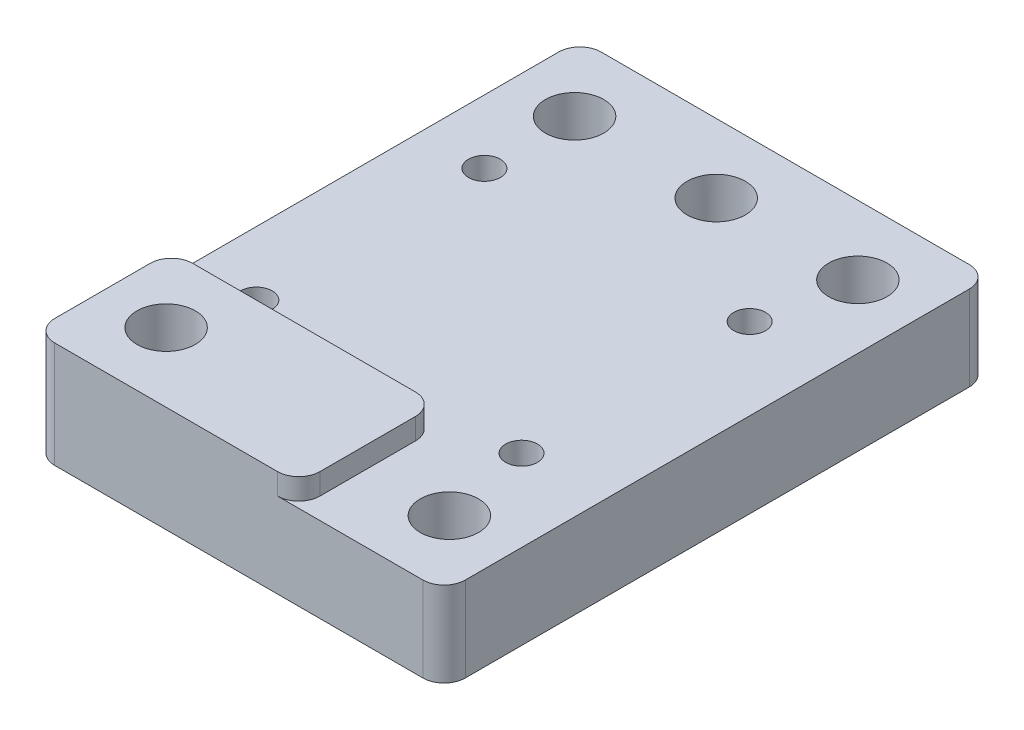
ISO-10303-21;
HEADER;
FILE_DESCRIPTION(('STEP AP214'),'2;1');
FILE_NAME('part.step','',(''),(''),'','','');
FILE_SCHEMA(('AUTOMOTIVE_DESIGN { 1 0 10303 214 1 1 1 1 }'));
ENDSEC;
DATA;
#1=APPLICATION_CONTEXT('core data for automotive mechanical design processes');
#2=APPLICATION_PROTOCOL_DEFINITION('international standard','automotive_design',2000,#1);
#3=PRODUCT_CONTEXT('',#1,'mechanical');
#4=PRODUCT('Part','Part','',(#3));
#5=PRODUCT_RELATED_PRODUCT_CATEGORY('part','',(#4));
#6=PRODUCT_DEFINITION_FORMATION('','',#4);
#7=PRODUCT_DEFINITION_CONTEXT('part definition',#1,'design');
#8=PRODUCT_DEFINITION('design','',#6,#7);
#9=PRODUCT_DEFINITION_SHAPE('','',#8);
#10=(LENGTH_UNIT() NAMED_UNIT(*) SI_UNIT(.MILLI.,.METRE.));
#11=(NAMED_UNIT(*) PLANE_ANGLE_UNIT() SI_UNIT($,.RADIAN.));
#12=(NAMED_UNIT(*) SI_UNIT($,.STERADIAN.) SOLID_ANGLE_UNIT());
#13=UNCERTAINTY_MEASURE_WITH_UNIT(LENGTH_MEASURE(1.E-05),#10,'distance_accuracy_value','');
#14=(GEOMETRIC_REPRESENTATION_CONTEXT(3) GLOBAL_UNCERTAINTY_ASSIGNED_CONTEXT((#13)) GLOBAL_UNIT_ASSIGNED_CONTEXT((#10,
#11,#12)) REPRESENTATION_CONTEXT('',''));
#15=CARTESIAN_POINT('',(0.,0.,0.));
#16=DIRECTION('',(0.,0.,1.));
#17=DIRECTION('',(1.,0.,0.));
#18=AXIS2_PLACEMENT_3D('',#15,#16,#17);
#19=CARTESIAN_POINT('',(0.,8.,0.));
#20=DIRECTION('',(0.,-1.,0.));
#21=DIRECTION('',(0.,0.,-1.));
#22=AXIS2_PLACEMENT_3D('',#19,#20,#21);
#23=PLANE('',#22);
#24=CARTESIAN_POINT('',(0.,8.,-19.25));
#25=DIRECTION('',(0.,-1.,0.));
#26=DIRECTION('',(0.,0.,-1.));
#27=AXIS2_PLACEMENT_3D('',#24,#25,#26);
#28=CIRCLE('',#27,2.75);
#29=CARTESIAN_POINT('',(0.,8.,-22.));
#30=VERTEX_POINT('',#29);
#31=EDGE_CURVE('E323',#30,#30,#28,.T.);
#32=ORIENTED_EDGE('',*,*,#31,.T.);
#33=EDGE_LOOP('',(#32));
#34=FACE_BOUND('',#33,.T.);
#35=CARTESIAN_POINT('',(13.35,8.,-19.25));
#36=DIRECTION('',(0.,-1.,0.));
#37=DIRECTION('',(0.,0.,-1.));
#38=AXIS2_PLACEMENT_3D('',#35,#36,#37);
#39=CIRCLE('',#38,2.75);
#40=CARTESIAN_POINT('',(13.35,8.,-22.));
#41=VERTEX_POINT('',#40);
#42=EDGE_CURVE('E317',#41,#41,#39,.F.);
#43=ORIENTED_EDGE('',*,*,#42,.F.);
#44=EDGE_LOOP('',(#43));
#45=FACE_BOUND('',#44,.T.);
#46=CARTESIAN_POINT('',(-13.35,8.,-19.25));
#47=DIRECTION('',(0.,-1.,0.));
#48=DIRECTION('',(0.,0.,-1.));
#49=AXIS2_PLACEMENT_3D('',#46,#47,#48);
#50=CIRCLE('',#49,2.75);
#51=CARTESIAN_POINT('',(-13.35,8.,-22.));
#52=VERTEX_POINT('',#51);
#53=EDGE_CURVE('E311',#52,#52,#50,.T.);
#54=ORIENTED_EDGE('',*,*,#53,.T.);
#55=EDGE_LOOP('',(#54));
#56=FACE_BOUND('',#55,.T.);
#57=CARTESIAN_POINT('',(13.35,8.,19.25));
#58=DIRECTION('',(0.,-1.,0.));
#59=DIRECTION('',(0.,0.,-1.));
#60=AXIS2_PLACEMENT_3D('',#57,#58,#59);
#61=CIRCLE('',#60,2.75);
#62=CARTESIAN_POINT('',(13.35,8.,16.5));
#63=VERTEX_POINT('',#62);
#64=EDGE_CURVE('E163',#63,#63,#61,.T.);
#65=ORIENTED_EDGE('',*,*,#64,.T.);
#66=EDGE_LOOP('',(#65));
#67=FACE_BOUND('',#66,.T.);
#68=CARTESIAN_POINT('',(-13.35,8.,-10.75));
#69=DIRECTION('',(0.,1.,0.));
#70=DIRECTION('',(0.,0.,1.));
#71=AXIS2_PLACEMENT_3D('',#68,#69,#70);
#72=CIRCLE('',#71,1.5);
#73=CARTESIAN_POINT('',(-13.35,8.,-9.25));
#74=VERTEX_POINT('',#73);
#75=EDGE_CURVE('E177',#74,#74,#72,.T.);
#76=ORIENTED_EDGE('',*,*,#75,.F.);
#77=EDGE_LOOP('',(#76));
#78=FACE_BOUND('',#77,.T.);
#79=CARTESIAN_POINT('',(11.65,8.,-10.75));
#80=DIRECTION('',(0.,1.,0.));
#81=DIRECTION('',(0.,0.,1.));
#82=AXIS2_PLACEMENT_3D('',#79,#80,#81);
#83=CIRCLE('',#82,1.5);
#84=CARTESIAN_POINT('',(11.65,8.,-9.25));
#85=VERTEX_POINT('',#84);
#86=EDGE_CURVE('E191',#85,#85,#83,.T.);
#87=ORIENTED_EDGE('',*,*,#86,.F.);
#88=EDGE_LOOP('',(#87));
#89=FACE_BOUND('',#88,.T.);
#90=CARTESIAN_POINT('',(-13.35,8.,10.75));
#91=DIRECTION('',(0.,-1.,0.));
#92=DIRECTION('',(0.,0.,-1.));
#93=AXIS2_PLACEMENT_3D('',#90,#91,#92);
#94=CIRCLE('',#93,1.5);
#95=CARTESIAN_POINT('',(-13.35,8.,9.25));
#96=VERTEX_POINT('',#95);
#97=EDGE_CURVE('E184',#96,#96,#94,.T.);
#98=ORIENTED_EDGE('',*,*,#97,.T.);
#99=EDGE_LOOP('',(#98));
#100=FACE_BOUND('',#99,.T.);
#101=CARTESIAN_POINT('',(11.65,8.,10.75));
#102=DIRECTION('',(0.,-1.,0.));
#103=DIRECTION('',(0.,0.,-1.));
#104=AXIS2_PLACEMENT_3D('',#101,#102,#103);
#105=CIRCLE('',#104,1.5);
#106=CARTESIAN_POINT('',(11.65,8.,9.25));
#107=VERTEX_POINT('',#106);
#108=EDGE_CURVE('E178',#107,#107,#105,.T.);
#109=ORIENTED_EDGE('',*,*,#108,.T.);
#110=EDGE_LOOP('',(#109));
#111=FACE_BOUND('',#110,.T.);
#112=DIRECTION('',(-1.,0.,0.));
#113=VECTOR('',#112,1.);
#114=CARTESIAN_POINT('',(-19.35,8.,-25.75));
#115=LINE('',#114,#113);
#116=CARTESIAN_POINT('',(17.35,8.,-25.75));
#117=VERTEX_POINT('',#116);
#118=CARTESIAN_POINT('',(-17.35,8.,-25.75));
#119=VERTEX_POINT('',#118);
#120=EDGE_CURVE('E201',#117,#119,#115,.T.);
#121=ORIENTED_EDGE('',*,*,#120,.T.);
#122=CARTESIAN_POINT('',(-17.35,8.,-23.75));
#123=DIRECTION('',(0.,-1.,0.));
#124=DIRECTION('',(0.,0.,-1.));
#125=AXIS2_PLACEMENT_3D('',#122,#123,#124);
#126=CIRCLE('',#125,2.);
#127=CARTESIAN_POINT('',(-19.35,8.,-23.75));
#128=VERTEX_POINT('',#127);
#129=EDGE_CURVE('E256',#119,#128,#126,.F.);
#130=ORIENTED_EDGE('',*,*,#129,.T.);
#131=DIRECTION('',(0.,0.,1.));
#132=VECTOR('',#131,1.);
#133=CARTESIAN_POINT('',(-19.35,8.,25.75));
#134=LINE('',#133,#132);
#135=CARTESIAN_POINT('',(-19.35,8.,14.75));
#136=VERTEX_POINT('',#135);
#137=EDGE_CURVE('E204',#128,#136,#134,.T.);
#138=ORIENTED_EDGE('',*,*,#137,.T.);
#139=CARTESIAN_POINT('',(-17.35,8.,14.75));
#140=DIRECTION('',(0.,-1.,0.));
#141=DIRECTION('',(0.,0.,-1.));
#142=AXIS2_PLACEMENT_3D('',#139,#140,#141);
#143=CIRCLE('',#142,2.);
#144=CARTESIAN_POINT('',(-17.35,8.,12.75));
#145=VERTEX_POINT('',#144);
#146=EDGE_CURVE('E146',#136,#145,#143,.T.);
#147=ORIENTED_EDGE('',*,*,#146,.T.);
#148=DIRECTION('',(-1.,0.,0.));
#149=VECTOR('',#148,1.);
#150=CARTESIAN_POINT('',(5.65,8.,12.75));
#151=LINE('',#150,#149);
#152=CARTESIAN_POINT('',(3.65,8.,12.75));
#153=VERTEX_POINT('',#152);
#154=EDGE_CURVE('E162',#153,#145,#151,.T.);
#155=ORIENTED_EDGE('',*,*,#154,.F.);
#156=CARTESIAN_POINT('',(3.65,8.,14.75));
#157=DIRECTION('',(0.,-1.,0.));
#158=DIRECTION('',(0.,0.,-1.));
#159=AXIS2_PLACEMENT_3D('',#156,#157,#158);
#160=CIRCLE('',#159,2.);
#161=CARTESIAN_POINT('',(5.65,8.,14.75));
#162=VERTEX_POINT('',#161);
#163=EDGE_CURVE('E161',#153,#162,#160,.T.);
#164=ORIENTED_EDGE('',*,*,#163,.T.);
#165=DIRECTION('',(0.,0.,-1.));
#166=VECTOR('',#165,1.);
#167=CARTESIAN_POINT('',(5.65,8.,12.75));
#168=LINE('',#167,#166);
#169=CARTESIAN_POINT('',(5.65,8.,23.75));
#170=VERTEX_POINT('',#169);
#171=EDGE_CURVE('E153',#170,#162,#168,.T.);
#172=ORIENTED_EDGE('',*,*,#171,.F.);
#173=CARTESIAN_POINT('',(3.65,8.,23.75));
#174=DIRECTION('',(0.,-1.,0.));
#175=DIRECTION('',(0.,0.,-1.));
#176=AXIS2_PLACEMENT_3D('',#173,#174,#175);
#177=CIRCLE('',#176,2.);
#178=CARTESIAN_POINT('',(3.65,8.,25.75));
#179=VERTEX_POINT('',#178);
#180=EDGE_CURVE('E136',#170,#179,#177,.T.);
#181=ORIENTED_EDGE('',*,*,#180,.T.);
#182=DIRECTION('',(1.,0.,0.));
#183=VECTOR('',#182,1.);
#184=CARTESIAN_POINT('',(-19.35,8.,25.75));
#185=LINE('',#184,#183);
#186=CARTESIAN_POINT('',(17.35,8.,25.75));
#187=VERTEX_POINT('',#186);
#188=EDGE_CURVE('E206',#179,#187,#185,.T.);
#189=ORIENTED_EDGE('',*,*,#188,.T.);
#190=CARTESIAN_POINT('',(17.35,8.,23.75));
#191=DIRECTION('',(0.,-1.,0.));
#192=DIRECTION('',(0.,0.,-1.));
#193=AXIS2_PLACEMENT_3D('',#190,#191,#192);
#194=CIRCLE('',#193,2.);
#195=CARTESIAN_POINT('',(19.35,8.,23.75));
#196=VERTEX_POINT('',#195);
#197=EDGE_CURVE('E252',#187,#196,#194,.F.);
#198=ORIENTED_EDGE('',*,*,#197,.T.);
#199=DIRECTION('',(0.,0.,-1.));
#200=VECTOR('',#199,1.);
#201=CARTESIAN_POINT('',(19.35,8.,25.75));
#202=LINE('',#201,#200);
#203=CARTESIAN_POINT('',(19.35,8.,-23.75));
#204=VERTEX_POINT('',#203);
#205=EDGE_CURVE('E199',#196,#204,#202,.T.);
#206=ORIENTED_EDGE('',*,*,#205,.T.);
#207=CARTESIAN_POINT('',(17.35,8.,-23.75));
#208=DIRECTION('',(0.,-1.,0.));
#209=DIRECTION('',(0.,0.,-1.));
#210=AXIS2_PLACEMENT_3D('',#207,#208,#209);
#211=CIRCLE('',#210,2.);
#212=EDGE_CURVE('E254',#204,#117,#211,.F.);
#213=ORIENTED_EDGE('',*,*,#212,.T.);
#214=EDGE_LOOP('',(#121,#130,#138,#147,#155,#164,#172,#181,#189,#198,#206,#213));
#215=FACE_BOUND('',#214,.T.);
#216=ADVANCED_FACE('F33',(#34,#45,#56,#67,#78,#89,#100,#111,#215),#23,.F.);
#217=CARTESIAN_POINT('',(19.35,8.,25.75));
#218=DIRECTION('',(-1.,0.,0.));
#219=DIRECTION('',(0.,0.,1.));
#220=AXIS2_PLACEMENT_3D('',#217,#218,#219);
#221=PLANE('',#220);
#222=DIRECTION('',(0.,0.,-1.));
#223=VECTOR('',#222,1.);
#224=CARTESIAN_POINT('',(19.35,0.,25.75));
#225=LINE('',#224,#223);
#226=CARTESIAN_POINT('',(19.35,0.,23.75));
#227=VERTEX_POINT('',#226);
#228=CARTESIAN_POINT('',(19.35,0.,-23.75));
#229=VERTEX_POINT('',#228);
#230=EDGE_CURVE('E190',#227,#229,#225,.T.);
#231=ORIENTED_EDGE('',*,*,#230,.T.);
#232=DIRECTION('',(0.,-1.,0.));
#233=VECTOR('',#232,1.);
#234=CARTESIAN_POINT('',(19.35,8.,-23.75));
#235=LINE('',#234,#233);
#236=EDGE_CURVE('E54',#229,#204,#235,.F.);
#237=ORIENTED_EDGE('',*,*,#236,.T.);
#238=ORIENTED_EDGE('',*,*,#205,.F.);
#239=DIRECTION('',(0.,-1.,0.));
#240=VECTOR('',#239,1.);
#241=CARTESIAN_POINT('',(19.35,8.,23.75));
#242=LINE('',#241,#240);
#243=EDGE_CURVE('E258',#196,#227,#242,.T.);
#244=ORIENTED_EDGE('',*,*,#243,.T.);
#245=EDGE_LOOP('',(#231,#237,#238,#244));
#246=FACE_BOUND('',#245,.T.);
#247=ADVANCED_FACE('F273',(#246),#221,.F.);
#248=CARTESIAN_POINT('',(-19.35,8.,-25.75));
#249=DIRECTION('',(0.,0.,1.));
#250=DIRECTION('',(1.,0.,0.));
#251=AXIS2_PLACEMENT_3D('',#248,#249,#250);
#252=PLANE('',#251);
#253=DIRECTION('',(-1.,0.,0.));
#254=VECTOR('',#253,1.);
#255=CARTESIAN_POINT('',(-19.35,0.,-25.75));
#256=LINE('',#255,#254);
#257=CARTESIAN_POINT('',(17.35,0.,-25.75));
#258=VERTEX_POINT('',#257);
#259=CARTESIAN_POINT('',(-17.35,0.,-25.75));
#260=VERTEX_POINT('',#259);
#261=EDGE_CURVE('E209',#258,#260,#256,.T.);
#262=ORIENTED_EDGE('',*,*,#261,.T.);
#263=DIRECTION('',(0.,-1.,0.));
#264=VECTOR('',#263,1.);
#265=CARTESIAN_POINT('',(-17.35,8.,-25.75));
#266=LINE('',#265,#264);
#267=EDGE_CURVE('E250',#260,#119,#266,.F.);
#268=ORIENTED_EDGE('',*,*,#267,.T.);
#269=ORIENTED_EDGE('',*,*,#120,.F.);
#270=DIRECTION('',(0.,-1.,0.));
#271=VECTOR('',#270,1.);
#272=CARTESIAN_POINT('',(17.35,8.,-25.75));
#273=LINE('',#272,#271);
#274=EDGE_CURVE('E247',#117,#258,#273,.T.);
#275=ORIENTED_EDGE('',*,*,#274,.T.);
#276=EDGE_LOOP('',(#262,#268,#269,#275));
#277=FACE_BOUND('',#276,.T.);
#278=ADVANCED_FACE('F284',(#277),#252,.F.);
#279=CARTESIAN_POINT('',(-19.35,8.,25.75));
#280=DIRECTION('',(1.,0.,0.));
#281=DIRECTION('',(0.,0.,-1.));
#282=AXIS2_PLACEMENT_3D('',#279,#280,#281);
#283=PLANE('',#282);
#284=ORIENTED_EDGE('',*,*,#137,.F.);
#285=DIRECTION('',(0.,-1.,0.));
#286=VECTOR('',#285,1.);
#287=CARTESIAN_POINT('',(-19.35,8.,-23.75));
#288=LINE('',#287,#286);
#289=CARTESIAN_POINT('',(-19.35,0.,-23.75));
#290=VERTEX_POINT('',#289);
#291=EDGE_CURVE('E236',#128,#290,#288,.T.);
#292=ORIENTED_EDGE('',*,*,#291,.T.);
#293=DIRECTION('',(0.,0.,1.));
#294=VECTOR('',#293,1.);
#295=CARTESIAN_POINT('',(-19.35,0.,25.75));
#296=LINE('',#295,#294);
#297=CARTESIAN_POINT('',(-19.35,0.,23.75));
#298=VERTEX_POINT('',#297);
#299=EDGE_CURVE('E212',#290,#298,#296,.T.);
#300=ORIENTED_EDGE('',*,*,#299,.T.);
#301=DIRECTION('',(0.,-1.,0.));
#302=VECTOR('',#301,1.);
#303=CARTESIAN_POINT('',(-19.35,8.,23.75));
#304=LINE('',#303,#302);
#305=CARTESIAN_POINT('',(-19.35,10.,23.75));
#306=VERTEX_POINT('',#305);
#307=EDGE_CURVE('E234',#298,#306,#304,.F.);
#308=ORIENTED_EDGE('',*,*,#307,.T.);
#309=DIRECTION('',(0.,0.,1.));
#310=VECTOR('',#309,1.);
#311=CARTESIAN_POINT('',(-19.35,10.,12.75));
#312=LINE('',#311,#310);
#313=CARTESIAN_POINT('',(-19.35,10.,14.75));
#314=VERTEX_POINT('',#313);
#315=EDGE_CURVE('E296',#314,#306,#312,.T.);
#316=ORIENTED_EDGE('',*,*,#315,.F.);
#317=DIRECTION('',(0.,-1.,0.));
#318=VECTOR('',#317,1.);
#319=CARTESIAN_POINT('',(-19.35,8.,14.75));
#320=LINE('',#319,#318);
#321=EDGE_CURVE('E225',#314,#136,#320,.T.);
#322=ORIENTED_EDGE('',*,*,#321,.T.);
#323=EDGE_LOOP('',(#284,#292,#300,#308,#316,#322));
#324=FACE_BOUND('',#323,.T.);
#325=ADVANCED_FACE('F292',(#324),#283,.F.);
#326=CARTESIAN_POINT('',(-19.35,8.,25.75));
#327=DIRECTION('',(0.,0.,-1.));
#328=DIRECTION('',(-1.,0.,0.));
#329=AXIS2_PLACEMENT_3D('',#326,#327,#328);
#330=PLANE('',#329);
#331=DIRECTION('',(1.,0.,0.));
#332=VECTOR('',#331,1.);
#333=CARTESIAN_POINT('',(-19.35,0.,25.75));
#334=LINE('',#333,#332);
#335=CARTESIAN_POINT('',(-17.35,0.,25.75));
#336=VERTEX_POINT('',#335);
#337=CARTESIAN_POINT('',(17.35,0.,25.75));
#338=VERTEX_POINT('',#337);
#339=EDGE_CURVE('E202',#336,#338,#334,.T.);
#340=ORIENTED_EDGE('',*,*,#339,.T.);
#341=DIRECTION('',(0.,-1.,0.));
#342=VECTOR('',#341,1.);
#343=CARTESIAN_POINT('',(17.35,8.,25.75));
#344=LINE('',#343,#342);
#345=EDGE_CURVE('E41',#338,#187,#344,.F.);
#346=ORIENTED_EDGE('',*,*,#345,.T.);
#347=ORIENTED_EDGE('',*,*,#188,.F.);
#348=DIRECTION('',(0.,-1.,0.));
#349=VECTOR('',#348,1.);
#350=CARTESIAN_POINT('',(3.65,8.,25.75));
#351=LINE('',#350,#349);
#352=CARTESIAN_POINT('',(3.65,10.,25.75));
#353=VERTEX_POINT('',#352);
#354=EDGE_CURVE('E142',#179,#353,#351,.F.);
#355=ORIENTED_EDGE('',*,*,#354,.T.);
#356=DIRECTION('',(1.,0.,0.));
#357=VECTOR('',#356,1.);
#358=CARTESIAN_POINT('',(5.65,10.,25.75));
#359=LINE('',#358,#357);
#360=CARTESIAN_POINT('',(-17.35,10.,25.75));
#361=VERTEX_POINT('',#360);
#362=EDGE_CURVE('E171',#361,#353,#359,.T.);
#363=ORIENTED_EDGE('',*,*,#362,.F.);
#364=DIRECTION('',(0.,-1.,0.));
#365=VECTOR('',#364,1.);
#366=CARTESIAN_POINT('',(-17.35,8.,25.75));
#367=LINE('',#366,#365);
#368=EDGE_CURVE('E262',#361,#336,#367,.T.);
#369=ORIENTED_EDGE('',*,*,#368,.T.);
#370=EDGE_LOOP('',(#340,#346,#347,#355,#363,#369));
#371=FACE_BOUND('',#370,.T.);
#372=ADVANCED_FACE('F266',(#371),#330,.F.);
#373=CARTESIAN_POINT('',(0.,0.,0.));
#374=DIRECTION('',(0.,-1.,0.));
#375=DIRECTION('',(0.,0.,-1.));
#376=AXIS2_PLACEMENT_3D('',#373,#374,#375);
#377=PLANE('',#376);
#378=CARTESIAN_POINT('',(0.,0.,-19.25));
#379=DIRECTION('',(0.,1.,0.));
#380=DIRECTION('',(0.,0.,1.));
#381=AXIS2_PLACEMENT_3D('',#378,#379,#380);
#382=CIRCLE('',#381,2.75);
#383=CARTESIAN_POINT('',(0.,0.,-16.5));
#384=VERTEX_POINT('',#383);
#385=EDGE_CURVE('E326',#384,#384,#382,.T.);
#386=ORIENTED_EDGE('',*,*,#385,.T.);
#387=EDGE_LOOP('',(#386));
#388=FACE_BOUND('',#387,.T.);
#389=CARTESIAN_POINT('',(13.35,0.,-19.25));
#390=DIRECTION('',(0.,-1.,0.));
#391=DIRECTION('',(0.,0.,-1.));
#392=AXIS2_PLACEMENT_3D('',#389,#390,#391);
#393=CIRCLE('',#392,2.75);
#394=CARTESIAN_POINT('',(13.35,0.,-22.));
#395=VERTEX_POINT('',#394);
#396=EDGE_CURVE('E320',#395,#395,#393,.T.);
#397=ORIENTED_EDGE('',*,*,#396,.F.);
#398=EDGE_LOOP('',(#397));
#399=FACE_BOUND('',#398,.T.);
#400=CARTESIAN_POINT('',(-13.35,0.,-19.25));
#401=DIRECTION('',(0.,1.,0.));
#402=DIRECTION('',(0.,0.,-1.));
#403=AXIS2_PLACEMENT_3D('',#400,#401,#402);
#404=CIRCLE('',#403,2.75);
#405=CARTESIAN_POINT('',(-13.35,0.,-22.));
#406=VERTEX_POINT('',#405);
#407=EDGE_CURVE('E314',#406,#406,#404,.T.);
#408=ORIENTED_EDGE('',*,*,#407,.T.);
#409=EDGE_LOOP('',(#408));
#410=FACE_BOUND('',#409,.T.);
#411=CARTESIAN_POINT('',(-13.35,0.,19.25));
#412=DIRECTION('',(0.,-1.,0.));
#413=DIRECTION('',(0.,0.,1.));
#414=AXIS2_PLACEMENT_3D('',#411,#412,#413);
#415=CIRCLE('',#414,2.75);
#416=CARTESIAN_POINT('',(-13.35,0.,22.));
#417=VERTEX_POINT('',#416);
#418=EDGE_CURVE('E305',#417,#417,#415,.T.);
#419=ORIENTED_EDGE('',*,*,#418,.F.);
#420=EDGE_LOOP('',(#419));
#421=FACE_BOUND('',#420,.T.);
#422=CARTESIAN_POINT('',(13.35,0.,19.25));
#423=DIRECTION('',(0.,1.,0.));
#424=DIRECTION('',(0.,0.,1.));
#425=AXIS2_PLACEMENT_3D('',#422,#423,#424);
#426=CIRCLE('',#425,2.75);
#427=CARTESIAN_POINT('',(13.35,0.,22.));
#428=VERTEX_POINT('',#427);
#429=EDGE_CURVE('E168',#428,#428,#426,.T.);
#430=ORIENTED_EDGE('',*,*,#429,.T.);
#431=EDGE_LOOP('',(#430));
#432=FACE_BOUND('',#431,.T.);
#433=CARTESIAN_POINT('',(11.65,0.,10.75));
#434=DIRECTION('',(0.,-1.,0.));
#435=DIRECTION('',(0.,0.,-1.));
#436=AXIS2_PLACEMENT_3D('',#433,#434,#435);
#437=CIRCLE('',#436,1.5);
#438=CARTESIAN_POINT('',(11.65,0.,9.25));
#439=VERTEX_POINT('',#438);
#440=EDGE_CURVE('E174',#439,#439,#437,.T.);
#441=ORIENTED_EDGE('',*,*,#440,.F.);
#442=EDGE_LOOP('',(#441));
#443=FACE_BOUND('',#442,.T.);
#444=CARTESIAN_POINT('',(-13.35,0.,10.75));
#445=DIRECTION('',(0.,-1.,0.));
#446=DIRECTION('',(0.,0.,-1.));
#447=AXIS2_PLACEMENT_3D('',#444,#445,#446);
#448=CIRCLE('',#447,1.5);
#449=CARTESIAN_POINT('',(-13.35,0.,9.25));
#450=VERTEX_POINT('',#449);
#451=EDGE_CURVE('E181',#450,#450,#448,.T.);
#452=ORIENTED_EDGE('',*,*,#451,.F.);
#453=EDGE_LOOP('',(#452));
#454=FACE_BOUND('',#453,.T.);
#455=CARTESIAN_POINT('',(11.65,0.,-10.75));
#456=DIRECTION('',(0.,1.,0.));
#457=DIRECTION('',(0.,0.,1.));
#458=AXIS2_PLACEMENT_3D('',#455,#456,#457);
#459=CIRCLE('',#458,1.5);
#460=CARTESIAN_POINT('',(11.65,0.,-9.25));
#461=VERTEX_POINT('',#460);
#462=EDGE_CURVE('E187',#461,#461,#459,.T.);
#463=ORIENTED_EDGE('',*,*,#462,.T.);
#464=EDGE_LOOP('',(#463));
#465=FACE_BOUND('',#464,.T.);
#466=CARTESIAN_POINT('',(-13.35,0.,-10.75));
#467=DIRECTION('',(0.,1.,0.));
#468=DIRECTION('',(0.,0.,1.));
#469=AXIS2_PLACEMENT_3D('',#466,#467,#468);
#470=CIRCLE('',#469,1.5);
#471=CARTESIAN_POINT('',(-13.35,0.,-9.25));
#472=VERTEX_POINT('',#471);
#473=EDGE_CURVE('E194',#472,#472,#470,.T.);
#474=ORIENTED_EDGE('',*,*,#473,.T.);
#475=EDGE_LOOP('',(#474));
#476=FACE_BOUND('',#475,.T.);
#477=ORIENTED_EDGE('',*,*,#299,.F.);
#478=CARTESIAN_POINT('',(-17.35,0.,-23.75));
#479=DIRECTION('',(0.,-1.,0.));
#480=DIRECTION('',(0.,0.,-1.));
#481=AXIS2_PLACEMENT_3D('',#478,#479,#480);
#482=CIRCLE('',#481,2.);
#483=EDGE_CURVE('E245',#290,#260,#482,.T.);
#484=ORIENTED_EDGE('',*,*,#483,.T.);
#485=ORIENTED_EDGE('',*,*,#261,.F.);
#486=CARTESIAN_POINT('',(17.35,0.,-23.75));
#487=DIRECTION('',(0.,-1.,0.));
#488=DIRECTION('',(0.,0.,-1.));
#489=AXIS2_PLACEMENT_3D('',#486,#487,#488);
#490=CIRCLE('',#489,2.);
#491=EDGE_CURVE('E243',#258,#229,#490,.T.);
#492=ORIENTED_EDGE('',*,*,#491,.T.);
#493=ORIENTED_EDGE('',*,*,#230,.F.);
#494=CARTESIAN_POINT('',(17.35,0.,23.75));
#495=DIRECTION('',(0.,-1.,0.));
#496=DIRECTION('',(0.,0.,-1.));
#497=AXIS2_PLACEMENT_3D('',#494,#495,#496);
#498=CIRCLE('',#497,2.);
#499=EDGE_CURVE('E241',#227,#338,#498,.T.);
#500=ORIENTED_EDGE('',*,*,#499,.T.);
#501=ORIENTED_EDGE('',*,*,#339,.F.);
#502=CARTESIAN_POINT('',(-17.35,0.,23.75));
#503=DIRECTION('',(0.,-1.,0.));
#504=DIRECTION('',(0.,0.,-1.));
#505=AXIS2_PLACEMENT_3D('',#502,#503,#504);
#506=CIRCLE('',#505,2.);
#507=EDGE_CURVE('E239',#336,#298,#506,.T.);
#508=ORIENTED_EDGE('',*,*,#507,.T.);
#509=EDGE_LOOP('',(#477,#484,#485,#492,#493,#500,#501,#508));
#510=FACE_BOUND('',#509,.T.);
#511=ADVANCED_FACE('F276',(#388,#399,#410,#421,#432,#443,#454,#465,#476,#510),#377,.T.);
#512=CARTESIAN_POINT('',(-13.35,0.,-10.75));
#513=DIRECTION('',(0.,1.,0.));
#514=DIRECTION('',(0.,0.,1.));
#515=AXIS2_PLACEMENT_3D('',#512,#513,#514);
#516=CYLINDRICAL_SURFACE('',#515,1.5);
#517=ORIENTED_EDGE('',*,*,#473,.F.);
#518=EDGE_LOOP('',(#517));
#519=FACE_BOUND('',#518,.T.);
#520=ORIENTED_EDGE('',*,*,#75,.T.);
#521=EDGE_LOOP('',(#520));
#522=FACE_BOUND('',#521,.T.);
#523=ADVANCED_FACE('F374',(#519,#522),#516,.F.);
#524=CARTESIAN_POINT('',(11.65,0.,-10.75));
#525=DIRECTION('',(0.,1.,0.));
#526=DIRECTION('',(0.,0.,1.));
#527=AXIS2_PLACEMENT_3D('',#524,#525,#526);
#528=CYLINDRICAL_SURFACE('',#527,1.5);
#529=ORIENTED_EDGE('',*,*,#462,.F.);
#530=EDGE_LOOP('',(#529));
#531=FACE_BOUND('',#530,.T.);
#532=ORIENTED_EDGE('',*,*,#86,.T.);
#533=EDGE_LOOP('',(#532));
#534=FACE_BOUND('',#533,.T.);
#535=ADVANCED_FACE('F367',(#531,#534),#528,.F.);
#536=CARTESIAN_POINT('',(-13.35,0.,10.75));
#537=DIRECTION('',(0.,1.,0.));
#538=DIRECTION('',(0.,0.,1.));
#539=AXIS2_PLACEMENT_3D('',#536,#537,#538);
#540=CYLINDRICAL_SURFACE('',#539,1.5);
#541=ORIENTED_EDGE('',*,*,#451,.T.);
#542=EDGE_LOOP('',(#541));
#543=FACE_BOUND('',#542,.T.);
#544=ORIENTED_EDGE('',*,*,#97,.F.);
#545=EDGE_LOOP('',(#544));
#546=FACE_BOUND('',#545,.T.);
#547=ADVANCED_FACE('F358',(#543,#546),#540,.F.);
#548=CARTESIAN_POINT('',(11.65,0.,10.75));
#549=DIRECTION('',(0.,1.,0.));
#550=DIRECTION('',(0.,0.,1.));
#551=AXIS2_PLACEMENT_3D('',#548,#549,#550);
#552=CYLINDRICAL_SURFACE('',#551,1.5);
#553=ORIENTED_EDGE('',*,*,#440,.T.);
#554=EDGE_LOOP('',(#553));
#555=FACE_BOUND('',#554,.T.);
#556=ORIENTED_EDGE('',*,*,#108,.F.);
#557=EDGE_LOOP('',(#556));
#558=FACE_BOUND('',#557,.T.);
#559=ADVANCED_FACE('F356',(#555,#558),#552,.F.);
#560=CARTESIAN_POINT('',(5.65,10.,12.75));
#561=DIRECTION('',(-1.,0.,0.));
#562=DIRECTION('',(0.,0.,1.));
#563=AXIS2_PLACEMENT_3D('',#560,#561,#562);
#564=PLANE('',#563);
#565=DIRECTION('',(0.,0.,-1.));
#566=VECTOR('',#565,1.);
#567=CARTESIAN_POINT('',(5.65,10.,12.75));
#568=LINE('',#567,#566);
#569=CARTESIAN_POINT('',(5.65,10.,23.75));
#570=VERTEX_POINT('',#569);
#571=CARTESIAN_POINT('',(5.65,10.,14.75));
#572=VERTEX_POINT('',#571);
#573=EDGE_CURVE('E156',#570,#572,#568,.T.);
#574=ORIENTED_EDGE('',*,*,#573,.F.);
#575=DIRECTION('',(0.,-1.,0.));
#576=VECTOR('',#575,1.);
#577=CARTESIAN_POINT('',(5.65,10.,23.75));
#578=LINE('',#577,#576);
#579=EDGE_CURVE('E140',#570,#170,#578,.T.);
#580=ORIENTED_EDGE('',*,*,#579,.T.);
#581=ORIENTED_EDGE('',*,*,#171,.T.);
#582=DIRECTION('',(0.,-1.,0.));
#583=VECTOR('',#582,1.);
#584=CARTESIAN_POINT('',(5.65,10.,14.75));
#585=LINE('',#584,#583);
#586=EDGE_CURVE('E157',#162,#572,#585,.F.);
#587=ORIENTED_EDGE('',*,*,#586,.T.);
#588=EDGE_LOOP('',(#574,#580,#581,#587));
#589=FACE_BOUND('',#588,.T.);
#590=ADVANCED_FACE('F152',(#589),#564,.F.);
#591=CARTESIAN_POINT('',(5.65,10.,12.75));
#592=DIRECTION('',(0.,0.,1.));
#593=DIRECTION('',(1.,0.,0.));
#594=AXIS2_PLACEMENT_3D('',#591,#592,#593);
#595=PLANE('',#594);
#596=ORIENTED_EDGE('',*,*,#154,.T.);
#597=DIRECTION('',(0.,-1.,0.));
#598=VECTOR('',#597,1.);
#599=CARTESIAN_POINT('',(-17.35,10.,12.75));
#600=LINE('',#599,#598);
#601=CARTESIAN_POINT('',(-17.35,10.,12.75));
#602=VERTEX_POINT('',#601);
#603=EDGE_CURVE('E147',#145,#602,#600,.F.);
#604=ORIENTED_EDGE('',*,*,#603,.T.);
#605=DIRECTION('',(-1.,0.,0.));
#606=VECTOR('',#605,1.);
#607=CARTESIAN_POINT('',(5.65,10.,12.75));
#608=LINE('',#607,#606);
#609=CARTESIAN_POINT('',(3.65,10.,12.75));
#610=VERTEX_POINT('',#609);
#611=EDGE_CURVE('E297',#610,#602,#608,.T.);
#612=ORIENTED_EDGE('',*,*,#611,.F.);
#613=DIRECTION('',(0.,-1.,0.));
#614=VECTOR('',#613,1.);
#615=CARTESIAN_POINT('',(3.65,10.,12.75));
#616=LINE('',#615,#614);
#617=EDGE_CURVE('E228',#610,#153,#616,.T.);
#618=ORIENTED_EDGE('',*,*,#617,.T.);
#619=EDGE_LOOP('',(#596,#604,#612,#618));
#620=FACE_BOUND('',#619,.T.);
#621=ADVANCED_FACE('F365',(#620),#595,.F.);
#622=CARTESIAN_POINT('',(0.,10.,0.));
#623=DIRECTION('',(0.,-1.,0.));
#624=DIRECTION('',(0.,0.,-1.));
#625=AXIS2_PLACEMENT_3D('',#622,#623,#624);
#626=PLANE('',#625);
#627=CARTESIAN_POINT('',(-13.35,10.,19.25));
#628=DIRECTION('',(0.,-1.,0.));
#629=DIRECTION('',(0.,0.,1.));
#630=AXIS2_PLACEMENT_3D('',#627,#628,#629);
#631=CIRCLE('',#630,2.75);
#632=CARTESIAN_POINT('',(-13.35,10.,22.));
#633=VERTEX_POINT('',#632);
#634=EDGE_CURVE('E308',#633,#633,#631,.T.);
#635=ORIENTED_EDGE('',*,*,#634,.T.);
#636=EDGE_LOOP('',(#635));
#637=FACE_BOUND('',#636,.T.);
#638=ORIENTED_EDGE('',*,*,#315,.T.);
#639=CARTESIAN_POINT('',(-17.35,10.,23.75));
#640=DIRECTION('',(0.,-1.,0.));
#641=DIRECTION('',(0.,0.,-1.));
#642=AXIS2_PLACEMENT_3D('',#639,#640,#641);
#643=CIRCLE('',#642,2.);
#644=EDGE_CURVE('E11',#306,#361,#643,.F.);
#645=ORIENTED_EDGE('',*,*,#644,.T.);
#646=ORIENTED_EDGE('',*,*,#362,.T.);
#647=CARTESIAN_POINT('',(3.65,10.,23.75));
#648=DIRECTION('',(0.,-1.,0.));
#649=DIRECTION('',(0.,0.,-1.));
#650=AXIS2_PLACEMENT_3D('',#647,#648,#649);
#651=CIRCLE('',#650,2.);
#652=EDGE_CURVE('E223',#353,#570,#651,.F.);
#653=ORIENTED_EDGE('',*,*,#652,.T.);
#654=ORIENTED_EDGE('',*,*,#573,.T.);
#655=CARTESIAN_POINT('',(3.65,10.,14.75));
#656=DIRECTION('',(0.,-1.,0.));
#657=DIRECTION('',(0.,0.,-1.));
#658=AXIS2_PLACEMENT_3D('',#655,#656,#657);
#659=CIRCLE('',#658,2.);
#660=EDGE_CURVE('E219',#572,#610,#659,.F.);
#661=ORIENTED_EDGE('',*,*,#660,.T.);
#662=ORIENTED_EDGE('',*,*,#611,.T.);
#663=CARTESIAN_POINT('',(-17.35,10.,14.75));
#664=DIRECTION('',(0.,-1.,0.));
#665=DIRECTION('',(0.,0.,-1.));
#666=AXIS2_PLACEMENT_3D('',#663,#664,#665);
#667=CIRCLE('',#666,2.);
#668=EDGE_CURVE('E221',#602,#314,#667,.F.);
#669=ORIENTED_EDGE('',*,*,#668,.T.);
#670=EDGE_LOOP('',(#638,#645,#646,#653,#654,#661,#662,#669));
#671=FACE_BOUND('',#670,.T.);
#672=ADVANCED_FACE('F430',(#637,#671),#626,.F.);
#673=CARTESIAN_POINT('',(13.35,0.,19.25));
#674=DIRECTION('',(0.,1.,0.));
#675=DIRECTION('',(0.,0.,1.));
#676=AXIS2_PLACEMENT_3D('',#673,#674,#675);
#677=CYLINDRICAL_SURFACE('',#676,2.75);
#678=ORIENTED_EDGE('',*,*,#429,.F.);
#679=EDGE_LOOP('',(#678));
#680=FACE_BOUND('',#679,.T.);
#681=ORIENTED_EDGE('',*,*,#64,.F.);
#682=EDGE_LOOP('',(#681));
#683=FACE_BOUND('',#682,.T.);
#684=ADVANCED_FACE('F435',(#680,#683),#677,.F.);
#685=CARTESIAN_POINT('',(-13.35,0.,19.25));
#686=DIRECTION('',(0.,1.,0.));
#687=DIRECTION('',(0.,0.,1.));
#688=AXIS2_PLACEMENT_3D('',#685,#686,#687);
#689=CYLINDRICAL_SURFACE('',#688,2.75);
#690=ORIENTED_EDGE('',*,*,#418,.T.);
#691=EDGE_LOOP('',(#690));
#692=FACE_BOUND('',#691,.T.);
#693=ORIENTED_EDGE('',*,*,#634,.F.);
#694=EDGE_LOOP('',(#693));
#695=FACE_BOUND('',#694,.T.);
#696=ADVANCED_FACE('F534',(#692,#695),#689,.F.);
#697=CARTESIAN_POINT('',(-13.35,0.,-19.25));
#698=DIRECTION('',(0.,1.,0.));
#699=DIRECTION('',(0.,0.,1.));
#700=AXIS2_PLACEMENT_3D('',#697,#698,#699);
#701=CYLINDRICAL_SURFACE('',#700,2.75);
#702=ORIENTED_EDGE('',*,*,#407,.F.);
#703=EDGE_LOOP('',(#702));
#704=FACE_BOUND('',#703,.T.);
#705=ORIENTED_EDGE('',*,*,#53,.F.);
#706=EDGE_LOOP('',(#705));
#707=FACE_BOUND('',#706,.T.);
#708=ADVANCED_FACE('F524',(#704,#707),#701,.F.);
#709=CARTESIAN_POINT('',(13.35,0.,-19.25));
#710=DIRECTION('',(0.,1.,0.));
#711=DIRECTION('',(0.,0.,1.));
#712=AXIS2_PLACEMENT_3D('',#709,#710,#711);
#713=CYLINDRICAL_SURFACE('',#712,2.75);
#714=ORIENTED_EDGE('',*,*,#396,.T.);
#715=EDGE_LOOP('',(#714));
#716=FACE_BOUND('',#715,.T.);
#717=ORIENTED_EDGE('',*,*,#42,.T.);
#718=EDGE_LOOP('',(#717));
#719=FACE_BOUND('',#718,.T.);
#720=ADVANCED_FACE('F335',(#716,#719),#713,.F.);
#721=CARTESIAN_POINT('',(0.,0.,-19.25));
#722=DIRECTION('',(0.,1.,0.));
#723=DIRECTION('',(0.,0.,1.));
#724=AXIS2_PLACEMENT_3D('',#721,#722,#723);
#725=CYLINDRICAL_SURFACE('',#724,2.75);
#726=ORIENTED_EDGE('',*,*,#385,.F.);
#727=EDGE_LOOP('',(#726));
#728=FACE_BOUND('',#727,.T.);
#729=ORIENTED_EDGE('',*,*,#31,.F.);
#730=EDGE_LOOP('',(#729));
#731=FACE_BOUND('',#730,.T.);
#732=ADVANCED_FACE('F332',(#728,#731),#725,.F.);
#733=CARTESIAN_POINT('',(3.65,10.,23.75));
#734=DIRECTION('',(0.,-1.,0.));
#735=DIRECTION('',(0.,0.,-1.));
#736=AXIS2_PLACEMENT_3D('',#733,#734,#735);
#737=CYLINDRICAL_SURFACE('',#736,2.);
#738=ORIENTED_EDGE('',*,*,#652,.F.);
#739=ORIENTED_EDGE('',*,*,#354,.F.);
#740=ORIENTED_EDGE('',*,*,#180,.F.);
#741=ORIENTED_EDGE('',*,*,#579,.F.);
#742=EDGE_LOOP('',(#738,#739,#740,#741));
#743=FACE_BOUND('',#742,.T.);
#744=ADVANCED_FACE('F139',(#743),#737,.T.);
#745=CARTESIAN_POINT('',(-17.35,8.,14.75));
#746=DIRECTION('',(0.,-1.,0.));
#747=DIRECTION('',(0.,0.,-1.));
#748=AXIS2_PLACEMENT_3D('',#745,#746,#747);
#749=CYLINDRICAL_SURFACE('',#748,2.);
#750=ORIENTED_EDGE('',*,*,#668,.F.);
#751=ORIENTED_EDGE('',*,*,#603,.F.);
#752=ORIENTED_EDGE('',*,*,#146,.F.);
#753=ORIENTED_EDGE('',*,*,#321,.F.);
#754=EDGE_LOOP('',(#750,#751,#752,#753));
#755=FACE_BOUND('',#754,.T.);
#756=ADVANCED_FACE('F391',(#755),#749,.T.);
#757=CARTESIAN_POINT('',(3.65,10.,14.75));
#758=DIRECTION('',(0.,-1.,0.));
#759=DIRECTION('',(0.,0.,-1.));
#760=AXIS2_PLACEMENT_3D('',#757,#758,#759);
#761=CYLINDRICAL_SURFACE('',#760,2.);
#762=ORIENTED_EDGE('',*,*,#660,.F.);
#763=ORIENTED_EDGE('',*,*,#586,.F.);
#764=ORIENTED_EDGE('',*,*,#163,.F.);
#765=ORIENTED_EDGE('',*,*,#617,.F.);
#766=EDGE_LOOP('',(#762,#763,#764,#765));
#767=FACE_BOUND('',#766,.T.);
#768=ADVANCED_FACE('F394',(#767),#761,.T.);
#769=CARTESIAN_POINT('',(-17.35,8.,-23.75));
#770=DIRECTION('',(0.,-1.,0.));
#771=DIRECTION('',(0.,0.,-1.));
#772=AXIS2_PLACEMENT_3D('',#769,#770,#771);
#773=CYLINDRICAL_SURFACE('',#772,2.);
#774=ORIENTED_EDGE('',*,*,#129,.F.);
#775=ORIENTED_EDGE('',*,*,#267,.F.);
#776=ORIENTED_EDGE('',*,*,#483,.F.);
#777=ORIENTED_EDGE('',*,*,#291,.F.);
#778=EDGE_LOOP('',(#774,#775,#776,#777));
#779=FACE_BOUND('',#778,.T.);
#780=ADVANCED_FACE('F290',(#779),#773,.T.);
#781=CARTESIAN_POINT('',(17.35,8.,-23.75));
#782=DIRECTION('',(0.,-1.,0.));
#783=DIRECTION('',(0.,0.,-1.));
#784=AXIS2_PLACEMENT_3D('',#781,#782,#783);
#785=CYLINDRICAL_SURFACE('',#784,2.);
#786=ORIENTED_EDGE('',*,*,#212,.F.);
#787=ORIENTED_EDGE('',*,*,#236,.F.);
#788=ORIENTED_EDGE('',*,*,#491,.F.);
#789=ORIENTED_EDGE('',*,*,#274,.F.);
#790=EDGE_LOOP('',(#786,#787,#788,#789));
#791=FACE_BOUND('',#790,.T.);
#792=ADVANCED_FACE('F281',(#791),#785,.T.);
#793=CARTESIAN_POINT('',(17.35,8.,23.75));
#794=DIRECTION('',(0.,-1.,0.));
#795=DIRECTION('',(0.,0.,-1.));
#796=AXIS2_PLACEMENT_3D('',#793,#794,#795);
#797=CYLINDRICAL_SURFACE('',#796,2.);
#798=ORIENTED_EDGE('',*,*,#197,.F.);
#799=ORIENTED_EDGE('',*,*,#345,.F.);
#800=ORIENTED_EDGE('',*,*,#499,.F.);
#801=ORIENTED_EDGE('',*,*,#243,.F.);
#802=EDGE_LOOP('',(#798,#799,#800,#801));
#803=FACE_BOUND('',#802,.T.);
#804=ADVANCED_FACE('F271',(#803),#797,.T.);
#805=CARTESIAN_POINT('',(-17.35,8.,23.75));
#806=DIRECTION('',(0.,-1.,0.));
#807=DIRECTION('',(0.,0.,-1.));
#808=AXIS2_PLACEMENT_3D('',#805,#806,#807);
#809=CYLINDRICAL_SURFACE('',#808,2.);
#810=ORIENTED_EDGE('',*,*,#644,.F.);
#811=ORIENTED_EDGE('',*,*,#307,.F.);
#812=ORIENTED_EDGE('',*,*,#507,.F.);
#813=ORIENTED_EDGE('',*,*,#368,.F.);
#814=EDGE_LOOP('',(#810,#811,#812,#813));
#815=FACE_BOUND('',#814,.T.);
#816=ADVANCED_FACE('F35',(#815),#809,.T.);
#817=CLOSED_SHELL('',(#216,#247,#278,#325,#372,#511,#523,#535,#547,#559,#590,#621,#672,#684,
#696,#708,#720,#732,#744,#756,#768,#780,#792,#804,#816));
#818=MANIFOLD_SOLID_BREP('B2',#817);
#819=ADVANCED_BREP_SHAPE_REPRESENTATION('',(#18,#818),#14);
#820=SHAPE_DEFINITION_REPRESENTATION(#9,#819);
ENDSEC;
END-ISO-10303-21;
